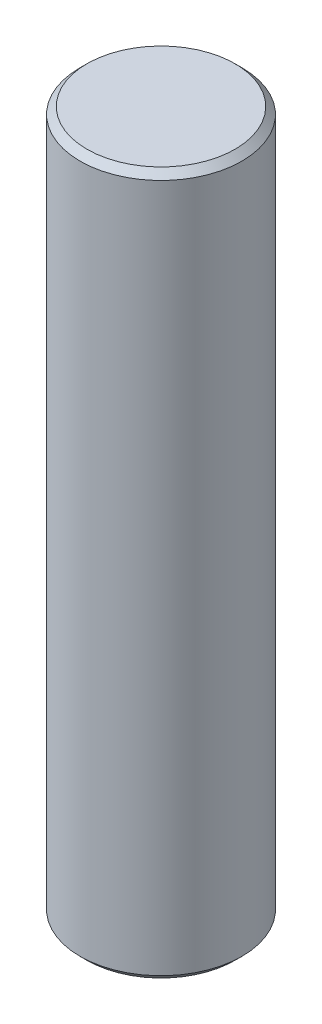
ISO-10303-21;
HEADER;
FILE_DESCRIPTION(('STEP AP214'),'2;1');
FILE_NAME('part.step','',(''),(''),'','','');
FILE_SCHEMA(('AUTOMOTIVE_DESIGN { 1 0 10303 214 1 1 1 1 }'));
ENDSEC;
DATA;
#1=APPLICATION_CONTEXT('core data for automotive mechanical design processes');
#2=APPLICATION_PROTOCOL_DEFINITION('international standard','automotive_design',2000,#1);
#3=PRODUCT_CONTEXT('',#1,'mechanical');
#4=PRODUCT('Part','Part','',(#3));
#5=PRODUCT_RELATED_PRODUCT_CATEGORY('part','',(#4));
#6=PRODUCT_DEFINITION_FORMATION('','',#4);
#7=PRODUCT_DEFINITION_CONTEXT('part definition',#1,'design');
#8=PRODUCT_DEFINITION('design','',#6,#7);
#9=PRODUCT_DEFINITION_SHAPE('','',#8);
#10=(LENGTH_UNIT() NAMED_UNIT(*) SI_UNIT(.MILLI.,.METRE.));
#11=(NAMED_UNIT(*) PLANE_ANGLE_UNIT() SI_UNIT($,.RADIAN.));
#12=(NAMED_UNIT(*) SI_UNIT($,.STERADIAN.) SOLID_ANGLE_UNIT());
#13=UNCERTAINTY_MEASURE_WITH_UNIT(LENGTH_MEASURE(1.E-05),#10,'distance_accuracy_value','');
#14=(GEOMETRIC_REPRESENTATION_CONTEXT(3) GLOBAL_UNCERTAINTY_ASSIGNED_CONTEXT((#13)) GLOBAL_UNIT_ASSIGNED_CONTEXT((#10,
#11,#12)) REPRESENTATION_CONTEXT('',''));
#15=CARTESIAN_POINT('',(0.,0.,0.));
#16=DIRECTION('',(0.,0.,1.));
#17=DIRECTION('',(1.,0.,0.));
#18=AXIS2_PLACEMENT_3D('',#15,#16,#17);
#19=CARTESIAN_POINT('',(0.,-25.6,0.));
#20=DIRECTION('',(0.,1.,0.));
#21=DIRECTION('',(0.,0.,1.));
#22=AXIS2_PLACEMENT_3D('',#19,#20,#21);
#23=CYLINDRICAL_SURFACE('',#22,2.95);
#24=CARTESIAN_POINT('',(0.,-0.25,0.));
#25=DIRECTION('',(0.,1.,0.));
#26=DIRECTION('',(0.,0.,1.));
#27=AXIS2_PLACEMENT_3D('',#24,#25,#26);
#28=CIRCLE('',#27,2.95);
#29=CARTESIAN_POINT('',(0.,-0.25,2.95));
#30=VERTEX_POINT('',#29);
#31=EDGE_CURVE('E10',#30,#30,#28,.F.);
#32=ORIENTED_EDGE('',*,*,#31,.T.);
#33=EDGE_LOOP('',(#32));
#34=FACE_BOUND('',#33,.T.);
#35=CARTESIAN_POINT('',(0.,-25.35,0.));
#36=DIRECTION('',(0.,1.,0.));
#37=DIRECTION('',(0.,0.,1.));
#38=AXIS2_PLACEMENT_3D('',#35,#36,#37);
#39=CIRCLE('',#38,2.95);
#40=CARTESIAN_POINT('',(0.,-25.35,2.95));
#41=VERTEX_POINT('',#40);
#42=EDGE_CURVE('E53',#41,#41,#39,.T.);
#43=ORIENTED_EDGE('',*,*,#42,.T.);
#44=EDGE_LOOP('',(#43));
#45=FACE_BOUND('',#44,.T.);
#46=ADVANCED_FACE('F37',(#34,#45),#23,.T.);
#47=CARTESIAN_POINT('',(0.,-25.6,0.));
#48=DIRECTION('',(0.,1.,0.));
#49=DIRECTION('',(0.,0.,1.));
#50=AXIS2_PLACEMENT_3D('',#47,#48,#49);
#51=PLANE('',#50);
#52=CARTESIAN_POINT('',(0.,-25.6,0.));
#53=DIRECTION('',(0.,1.,0.));
#54=DIRECTION('',(0.,0.,1.));
#55=AXIS2_PLACEMENT_3D('',#52,#53,#54);
#56=CIRCLE('',#55,2.7);
#57=CARTESIAN_POINT('',(0.,-25.6,2.7));
#58=VERTEX_POINT('',#57);
#59=EDGE_CURVE('E49',#58,#58,#56,.F.);
#60=ORIENTED_EDGE('',*,*,#59,.T.);
#61=EDGE_LOOP('',(#60));
#62=FACE_BOUND('',#61,.T.);
#63=ADVANCED_FACE('F69',(#62),#51,.F.);
#64=CARTESIAN_POINT('',(0.,0.,0.));
#65=DIRECTION('',(0.,1.,0.));
#66=DIRECTION('',(0.,0.,1.));
#67=AXIS2_PLACEMENT_3D('',#64,#65,#66);
#68=PLANE('',#67);
#69=CARTESIAN_POINT('',(0.,0.,0.));
#70=DIRECTION('',(0.,1.,0.));
#71=DIRECTION('',(0.,0.,1.));
#72=AXIS2_PLACEMENT_3D('',#69,#70,#71);
#73=CIRCLE('',#72,2.7);
#74=CARTESIAN_POINT('',(0.,0.,2.7));
#75=VERTEX_POINT('',#74);
#76=EDGE_CURVE('E45',#75,#75,#73,.T.);
#77=ORIENTED_EDGE('',*,*,#76,.T.);
#78=EDGE_LOOP('',(#77));
#79=FACE_BOUND('',#78,.T.);
#80=ADVANCED_FACE('F62',(#79),#68,.T.);
#81=CARTESIAN_POINT('',(0.,-25.35,0.));
#82=DIRECTION('',(0.,1.,0.));
#83=DIRECTION('',(0.,0.,1.));
#84=AXIS2_PLACEMENT_3D('',#81,#82,#83);
#85=CONICAL_SURFACE('',#84,2.95,0.785398163397447);
#86=ORIENTED_EDGE('',*,*,#59,.F.);
#87=EDGE_LOOP('',(#86));
#88=FACE_BOUND('',#87,.T.);
#89=ORIENTED_EDGE('',*,*,#42,.F.);
#90=EDGE_LOOP('',(#89));
#91=FACE_BOUND('',#90,.T.);
#92=ADVANCED_FACE('F60',(#88,#91),#85,.T.);
#93=CARTESIAN_POINT('',(0.,0.,0.));
#94=DIRECTION('',(0.,-1.,0.));
#95=DIRECTION('',(0.,0.,-1.));
#96=AXIS2_PLACEMENT_3D('',#93,#94,#95);
#97=CONICAL_SURFACE('',#96,2.7,0.785398163397447);
#98=ORIENTED_EDGE('',*,*,#31,.F.);
#99=EDGE_LOOP('',(#98));
#100=FACE_BOUND('',#99,.T.);
#101=ORIENTED_EDGE('',*,*,#76,.F.);
#102=EDGE_LOOP('',(#101));
#103=FACE_BOUND('',#102,.T.);
#104=ADVANCED_FACE('F40',(#100,#103),#97,.T.);
#105=CLOSED_SHELL('',(#46,#63,#80,#92,#104));
#106=MANIFOLD_SOLID_BREP('B2',#105);
#107=ADVANCED_BREP_SHAPE_REPRESENTATION('',(#18,#106),#14);
#108=SHAPE_DEFINITION_REPRESENTATION(#9,#107);
ENDSEC;
END-ISO-10303-21;
